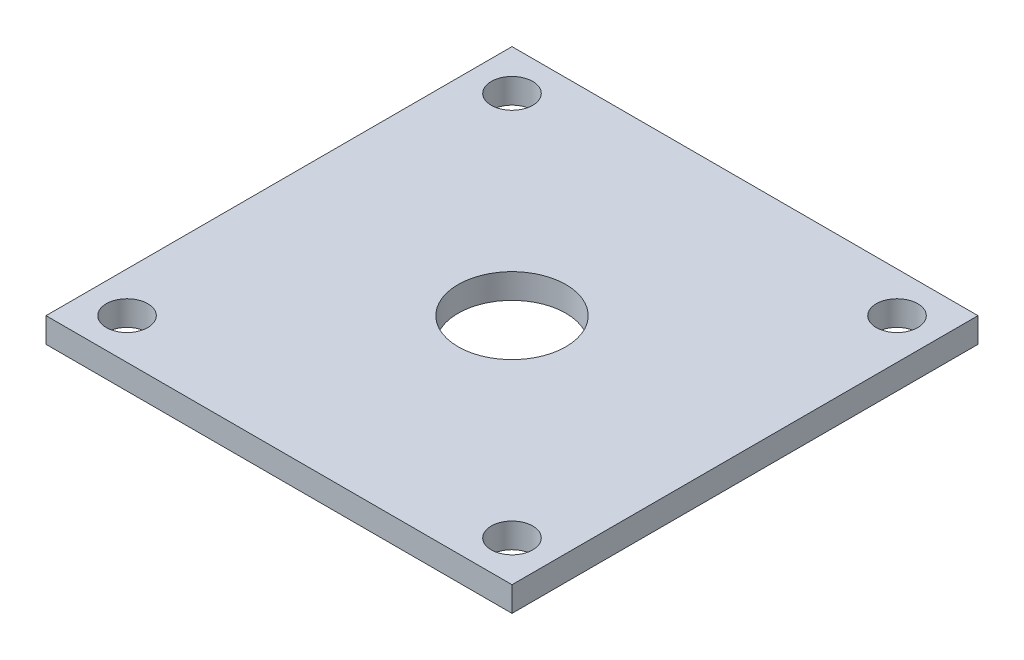
ISO-10303-21;
HEADER;
FILE_DESCRIPTION(('STEP AP214'),'2;1');
FILE_NAME('part.step','',(''),(''),'','','');
FILE_SCHEMA(('AUTOMOTIVE_DESIGN { 1 0 10303 214 1 1 1 1 }'));
ENDSEC;
DATA;
#1=APPLICATION_CONTEXT('core data for automotive mechanical design processes');
#2=APPLICATION_PROTOCOL_DEFINITION('international standard','automotive_design',2000,#1);
#3=PRODUCT_CONTEXT('',#1,'mechanical');
#4=PRODUCT('Part','Part','',(#3));
#5=PRODUCT_RELATED_PRODUCT_CATEGORY('part','',(#4));
#6=PRODUCT_DEFINITION_FORMATION('','',#4);
#7=PRODUCT_DEFINITION_CONTEXT('part definition',#1,'design');
#8=PRODUCT_DEFINITION('design','',#6,#7);
#9=PRODUCT_DEFINITION_SHAPE('','',#8);
#10=(LENGTH_UNIT() NAMED_UNIT(*) SI_UNIT(.MILLI.,.METRE.));
#11=(NAMED_UNIT(*) PLANE_ANGLE_UNIT() SI_UNIT($,.RADIAN.));
#12=(NAMED_UNIT(*) SI_UNIT($,.STERADIAN.) SOLID_ANGLE_UNIT());
#13=UNCERTAINTY_MEASURE_WITH_UNIT(LENGTH_MEASURE(1.E-05),#10,'distance_accuracy_value','');
#14=(GEOMETRIC_REPRESENTATION_CONTEXT(3) GLOBAL_UNCERTAINTY_ASSIGNED_CONTEXT((#13)) GLOBAL_UNIT_ASSIGNED_CONTEXT((#10,
#11,#12)) REPRESENTATION_CONTEXT('',''));
#15=CARTESIAN_POINT('',(0.,0.,0.));
#16=DIRECTION('',(0.,0.,1.));
#17=DIRECTION('',(1.,0.,0.));
#18=AXIS2_PLACEMENT_3D('',#15,#16,#17);
#19=CARTESIAN_POINT('',(35.687,88.9508,-35.687));
#20=DIRECTION('',(-1.,0.,0.));
#21=DIRECTION('',(0.,0.,1.));
#22=AXIS2_PLACEMENT_3D('',#19,#20,#21);
#23=PLANE('',#22);
#24=DIRECTION('',(0.,0.,1.));
#25=VECTOR('',#24,1.);
#26=CARTESIAN_POINT('',(35.687,85.1408,-35.687));
#27=LINE('',#26,#25);
#28=CARTESIAN_POINT('',(35.687,85.1408,-35.687));
#29=VERTEX_POINT('',#28);
#30=CARTESIAN_POINT('',(35.687,85.1408,35.687));
#31=VERTEX_POINT('',#30);
#32=EDGE_CURVE('E58',#29,#31,#27,.T.);
#33=ORIENTED_EDGE('',*,*,#32,.F.);
#34=DIRECTION('',(0.,-1.,0.));
#35=VECTOR('',#34,1.);
#36=CARTESIAN_POINT('',(35.687,88.9508,-35.687));
#37=LINE('',#36,#35);
#38=CARTESIAN_POINT('',(35.687,88.9508,-35.687));
#39=VERTEX_POINT('',#38);
#40=EDGE_CURVE('E12',#39,#29,#37,.T.);
#41=ORIENTED_EDGE('',*,*,#40,.F.);
#42=DIRECTION('',(0.,0.,-1.));
#43=VECTOR('',#42,1.);
#44=CARTESIAN_POINT('',(35.687,88.9508,-35.687));
#45=LINE('',#44,#43);
#46=CARTESIAN_POINT('',(35.687,88.9508,35.687));
#47=VERTEX_POINT('',#46);
#48=EDGE_CURVE('E121',#47,#39,#45,.T.);
#49=ORIENTED_EDGE('',*,*,#48,.F.);
#50=DIRECTION('',(0.,-1.,0.));
#51=VECTOR('',#50,1.);
#52=CARTESIAN_POINT('',(35.687,88.9508,35.687));
#53=LINE('',#52,#51);
#54=EDGE_CURVE('E108',#47,#31,#53,.T.);
#55=ORIENTED_EDGE('',*,*,#54,.T.);
#56=EDGE_LOOP('',(#33,#41,#49,#55));
#57=FACE_BOUND('',#56,.T.);
#58=ADVANCED_FACE('F42',(#57),#23,.F.);
#59=CARTESIAN_POINT('',(-35.687,88.9508,-35.687));
#60=DIRECTION('',(0.,0.,1.));
#61=DIRECTION('',(1.,0.,0.));
#62=AXIS2_PLACEMENT_3D('',#59,#60,#61);
#63=PLANE('',#62);
#64=DIRECTION('',(1.,0.,0.));
#65=VECTOR('',#64,1.);
#66=CARTESIAN_POINT('',(-35.687,85.1408,-35.687));
#67=LINE('',#66,#65);
#68=CARTESIAN_POINT('',(-35.687,85.1408,-35.687));
#69=VERTEX_POINT('',#68);
#70=EDGE_CURVE('E87',#69,#29,#67,.T.);
#71=ORIENTED_EDGE('',*,*,#70,.F.);
#72=DIRECTION('',(0.,-1.,0.));
#73=VECTOR('',#72,1.);
#74=CARTESIAN_POINT('',(-35.687,88.9508,-35.687));
#75=LINE('',#74,#73);
#76=CARTESIAN_POINT('',(-35.687,88.9508,-35.687));
#77=VERTEX_POINT('',#76);
#78=EDGE_CURVE('E51',#77,#69,#75,.T.);
#79=ORIENTED_EDGE('',*,*,#78,.F.);
#80=DIRECTION('',(-1.,0.,0.));
#81=VECTOR('',#80,1.);
#82=CARTESIAN_POINT('',(-35.687,88.9508,-35.687));
#83=LINE('',#82,#81);
#84=EDGE_CURVE('E118',#39,#77,#83,.T.);
#85=ORIENTED_EDGE('',*,*,#84,.F.);
#86=ORIENTED_EDGE('',*,*,#40,.T.);
#87=EDGE_LOOP('',(#71,#79,#85,#86));
#88=FACE_BOUND('',#87,.T.);
#89=ADVANCED_FACE('F97',(#88),#63,.F.);
#90=CARTESIAN_POINT('',(-35.687,88.9508,-35.687));
#91=DIRECTION('',(1.,0.,0.));
#92=DIRECTION('',(0.,0.,-1.));
#93=AXIS2_PLACEMENT_3D('',#90,#91,#92);
#94=PLANE('',#93);
#95=DIRECTION('',(0.,0.,1.));
#96=VECTOR('',#95,1.);
#97=CARTESIAN_POINT('',(-35.687,85.1408,-35.687));
#98=LINE('',#97,#96);
#99=CARTESIAN_POINT('',(-35.687,85.1408,35.687));
#100=VERTEX_POINT('',#99);
#101=EDGE_CURVE('E83',#69,#100,#98,.T.);
#102=ORIENTED_EDGE('',*,*,#101,.T.);
#103=DIRECTION('',(0.,-1.,0.));
#104=VECTOR('',#103,1.);
#105=CARTESIAN_POINT('',(-35.687,88.9508,35.687));
#106=LINE('',#105,#104);
#107=CARTESIAN_POINT('',(-35.687,88.9508,35.687));
#108=VERTEX_POINT('',#107);
#109=EDGE_CURVE('E105',#108,#100,#106,.T.);
#110=ORIENTED_EDGE('',*,*,#109,.F.);
#111=DIRECTION('',(0.,0.,1.));
#112=VECTOR('',#111,1.);
#113=CARTESIAN_POINT('',(-35.687,88.9508,-35.687));
#114=LINE('',#113,#112);
#115=EDGE_CURVE('E103',#77,#108,#114,.T.);
#116=ORIENTED_EDGE('',*,*,#115,.F.);
#117=ORIENTED_EDGE('',*,*,#78,.T.);
#118=EDGE_LOOP('',(#102,#110,#116,#117));
#119=FACE_BOUND('',#118,.T.);
#120=ADVANCED_FACE('F102',(#119),#94,.F.);
#121=CARTESIAN_POINT('',(-35.687,88.9508,35.687));
#122=DIRECTION('',(0.,0.,-1.));
#123=DIRECTION('',(-1.,0.,0.));
#124=AXIS2_PLACEMENT_3D('',#121,#122,#123);
#125=PLANE('',#124);
#126=DIRECTION('',(1.,0.,0.));
#127=VECTOR('',#126,1.);
#128=CARTESIAN_POINT('',(-35.687,85.1408,35.687));
#129=LINE('',#128,#127);
#130=EDGE_CURVE('E88',#100,#31,#129,.T.);
#131=ORIENTED_EDGE('',*,*,#130,.T.);
#132=ORIENTED_EDGE('',*,*,#54,.F.);
#133=DIRECTION('',(1.,0.,0.));
#134=VECTOR('',#133,1.);
#135=CARTESIAN_POINT('',(-35.687,88.9508,35.687));
#136=LINE('',#135,#134);
#137=EDGE_CURVE('E66',#108,#47,#136,.T.);
#138=ORIENTED_EDGE('',*,*,#137,.F.);
#139=ORIENTED_EDGE('',*,*,#109,.T.);
#140=EDGE_LOOP('',(#131,#132,#138,#139));
#141=FACE_BOUND('',#140,.T.);
#142=ADVANCED_FACE('F187',(#141),#125,.F.);
#143=CARTESIAN_POINT('',(0.,88.9528,0.));
#144=DIRECTION('',(0.,-1.,0.));
#145=DIRECTION('',(0.,0.,-1.));
#146=AXIS2_PLACEMENT_3D('',#143,#144,#145);
#147=CYLINDRICAL_SURFACE('',#146,8.255);
#148=CARTESIAN_POINT('',(0.,88.9508,0.));
#149=DIRECTION('',(0.,1.,0.));
#150=DIRECTION('',(0.,0.,1.));
#151=AXIS2_PLACEMENT_3D('',#148,#149,#150);
#152=CIRCLE('',#151,8.255);
#153=CARTESIAN_POINT('',(0.,88.9508,8.255));
#154=VERTEX_POINT('',#153);
#155=EDGE_CURVE('E124',#154,#154,#152,.F.);
#156=ORIENTED_EDGE('',*,*,#155,.F.);
#157=EDGE_LOOP('',(#156));
#158=FACE_BOUND('',#157,.T.);
#159=CARTESIAN_POINT('',(0.,85.1408,0.));
#160=DIRECTION('',(0.,-1.,0.));
#161=DIRECTION('',(0.,0.,-1.));
#162=AXIS2_PLACEMENT_3D('',#159,#160,#161);
#163=CIRCLE('',#162,8.255);
#164=CARTESIAN_POINT('',(0.,85.1408,-8.255));
#165=VERTEX_POINT('',#164);
#166=EDGE_CURVE('E45',#165,#165,#163,.F.);
#167=ORIENTED_EDGE('',*,*,#166,.F.);
#168=EDGE_LOOP('',(#167));
#169=FACE_BOUND('',#168,.T.);
#170=ADVANCED_FACE('F178',(#158,#169),#147,.F.);
#171=CARTESIAN_POINT('',(0.,88.9508,0.));
#172=DIRECTION('',(0.,1.,0.));
#173=DIRECTION('',(0.,0.,1.));
#174=AXIS2_PLACEMENT_3D('',#171,#172,#173);
#175=PLANE('',#174);
#176=CARTESIAN_POINT('',(29.4847950216924,88.9508,29.4847950216924));
#177=DIRECTION('',(0.,1.,0.));
#178=DIRECTION('',(0.,0.,1.));
#179=AXIS2_PLACEMENT_3D('',#176,#177,#178);
#180=CIRCLE('',#179,3.175);
#181=CARTESIAN_POINT('',(29.4847950216924,88.9508,32.6597950216924));
#182=VERTEX_POINT('',#181);
#183=EDGE_CURVE('E141',#182,#182,#180,.T.);
#184=ORIENTED_EDGE('',*,*,#183,.F.);
#185=EDGE_LOOP('',(#184));
#186=FACE_BOUND('',#185,.T.);
#187=CARTESIAN_POINT('',(-29.4825135870935,88.9508,-29.4825135870935));
#188=DIRECTION('',(0.,1.,0.));
#189=DIRECTION('',(0.,0.,1.));
#190=AXIS2_PLACEMENT_3D('',#187,#188,#189);
#191=CIRCLE('',#190,3.175);
#192=CARTESIAN_POINT('',(-29.4825135870935,88.9508,-26.3075135870935));
#193=VERTEX_POINT('',#192);
#194=EDGE_CURVE('E149',#193,#193,#191,.T.);
#195=ORIENTED_EDGE('',*,*,#194,.F.);
#196=EDGE_LOOP('',(#195));
#197=FACE_BOUND('',#196,.T.);
#198=CARTESIAN_POINT('',(29.4847950216924,88.9508,-29.4847950216924));
#199=DIRECTION('',(0.,1.,0.));
#200=DIRECTION('',(0.,0.,1.));
#201=AXIS2_PLACEMENT_3D('',#198,#199,#200);
#202=CIRCLE('',#201,3.175);
#203=CARTESIAN_POINT('',(29.4847950216924,88.9508,-26.3097950216924));
#204=VERTEX_POINT('',#203);
#205=EDGE_CURVE('E157',#204,#204,#202,.T.);
#206=ORIENTED_EDGE('',*,*,#205,.F.);
#207=EDGE_LOOP('',(#206));
#208=FACE_BOUND('',#207,.T.);
#209=CARTESIAN_POINT('',(-29.4812110895342,88.9508,29.4812110895342));
#210=DIRECTION('',(0.,1.,0.));
#211=DIRECTION('',(0.,0.,1.));
#212=AXIS2_PLACEMENT_3D('',#209,#210,#211);
#213=CIRCLE('',#212,3.175);
#214=CARTESIAN_POINT('',(-29.4812110895342,88.9508,32.6562110895342));
#215=VERTEX_POINT('',#214);
#216=EDGE_CURVE('E133',#215,#215,#213,.T.);
#217=ORIENTED_EDGE('',*,*,#216,.F.);
#218=EDGE_LOOP('',(#217));
#219=FACE_BOUND('',#218,.T.);
#220=ORIENTED_EDGE('',*,*,#155,.T.);
#221=EDGE_LOOP('',(#220));
#222=FACE_BOUND('',#221,.T.);
#223=ORIENTED_EDGE('',*,*,#48,.T.);
#224=ORIENTED_EDGE('',*,*,#84,.T.);
#225=ORIENTED_EDGE('',*,*,#115,.T.);
#226=ORIENTED_EDGE('',*,*,#137,.T.);
#227=EDGE_LOOP('',(#223,#224,#225,#226));
#228=FACE_BOUND('',#227,.T.);
#229=ADVANCED_FACE('F175',(#186,#197,#208,#219,#222,#228),#175,.T.);
#230=CARTESIAN_POINT('',(-35.687,85.1408,-35.687));
#231=DIRECTION('',(0.,-1.,0.));
#232=DIRECTION('',(0.,0.,-1.));
#233=AXIS2_PLACEMENT_3D('',#230,#231,#232);
#234=PLANE('',#233);
#235=CARTESIAN_POINT('',(29.4847950216924,85.1408,29.4847950216924));
#236=DIRECTION('',(0.,1.,0.));
#237=DIRECTION('',(0.,0.,1.));
#238=AXIS2_PLACEMENT_3D('',#235,#236,#237);
#239=CIRCLE('',#238,3.175);
#240=CARTESIAN_POINT('',(29.4847950216924,85.1408,32.6597950216924));
#241=VERTEX_POINT('',#240);
#242=EDGE_CURVE('E145',#241,#241,#239,.T.);
#243=ORIENTED_EDGE('',*,*,#242,.T.);
#244=EDGE_LOOP('',(#243));
#245=FACE_BOUND('',#244,.T.);
#246=CARTESIAN_POINT('',(-29.4825135870935,85.1408,-29.4825135870935));
#247=DIRECTION('',(0.,1.,0.));
#248=DIRECTION('',(0.,0.,1.));
#249=AXIS2_PLACEMENT_3D('',#246,#247,#248);
#250=CIRCLE('',#249,3.175);
#251=CARTESIAN_POINT('',(-29.4825135870935,85.1408,-26.3075135870935));
#252=VERTEX_POINT('',#251);
#253=EDGE_CURVE('E153',#252,#252,#250,.T.);
#254=ORIENTED_EDGE('',*,*,#253,.T.);
#255=EDGE_LOOP('',(#254));
#256=FACE_BOUND('',#255,.T.);
#257=CARTESIAN_POINT('',(29.4847950216924,85.1408,-29.4847950216924));
#258=DIRECTION('',(0.,1.,0.));
#259=DIRECTION('',(0.,0.,1.));
#260=AXIS2_PLACEMENT_3D('',#257,#258,#259);
#261=CIRCLE('',#260,3.175);
#262=CARTESIAN_POINT('',(29.4847950216924,85.1408,-26.3097950216924));
#263=VERTEX_POINT('',#262);
#264=EDGE_CURVE('E137',#263,#263,#261,.T.);
#265=ORIENTED_EDGE('',*,*,#264,.T.);
#266=EDGE_LOOP('',(#265));
#267=FACE_BOUND('',#266,.T.);
#268=CARTESIAN_POINT('',(-29.4812110895342,85.1408,29.4812110895342));
#269=DIRECTION('',(0.,1.,0.));
#270=DIRECTION('',(0.,0.,1.));
#271=AXIS2_PLACEMENT_3D('',#268,#269,#270);
#272=CIRCLE('',#271,3.175);
#273=CARTESIAN_POINT('',(-29.4812110895342,85.1408,32.6562110895342));
#274=VERTEX_POINT('',#273);
#275=EDGE_CURVE('E131',#274,#274,#272,.T.);
#276=ORIENTED_EDGE('',*,*,#275,.T.);
#277=EDGE_LOOP('',(#276));
#278=FACE_BOUND('',#277,.T.);
#279=ORIENTED_EDGE('',*,*,#130,.F.);
#280=ORIENTED_EDGE('',*,*,#101,.F.);
#281=ORIENTED_EDGE('',*,*,#70,.T.);
#282=ORIENTED_EDGE('',*,*,#32,.T.);
#283=EDGE_LOOP('',(#279,#280,#281,#282));
#284=FACE_BOUND('',#283,.T.);
#285=ORIENTED_EDGE('',*,*,#166,.T.);
#286=EDGE_LOOP('',(#285));
#287=FACE_BOUND('',#286,.T.);
#288=ADVANCED_FACE('F85',(#245,#256,#267,#278,#284,#287),#234,.T.);
#289=CARTESIAN_POINT('',(-29.4812110895342,85.1408,29.4812110895342));
#290=DIRECTION('',(0.,1.,0.));
#291=DIRECTION('',(0.,0.,1.));
#292=AXIS2_PLACEMENT_3D('',#289,#290,#291);
#293=CYLINDRICAL_SURFACE('',#292,3.175);
#294=ORIENTED_EDGE('',*,*,#275,.F.);
#295=EDGE_LOOP('',(#294));
#296=FACE_BOUND('',#295,.T.);
#297=ORIENTED_EDGE('',*,*,#216,.T.);
#298=EDGE_LOOP('',(#297));
#299=FACE_BOUND('',#298,.T.);
#300=ADVANCED_FACE('F171',(#296,#299),#293,.F.);
#301=CARTESIAN_POINT('',(29.4847950216924,85.1408,-29.4847950216924));
#302=DIRECTION('',(0.,1.,0.));
#303=DIRECTION('',(0.,0.,1.));
#304=AXIS2_PLACEMENT_3D('',#301,#302,#303);
#305=CYLINDRICAL_SURFACE('',#304,3.175);
#306=ORIENTED_EDGE('',*,*,#264,.F.);
#307=EDGE_LOOP('',(#306));
#308=FACE_BOUND('',#307,.T.);
#309=ORIENTED_EDGE('',*,*,#205,.T.);
#310=EDGE_LOOP('',(#309));
#311=FACE_BOUND('',#310,.T.);
#312=ADVANCED_FACE('F167',(#308,#311),#305,.F.);
#313=CARTESIAN_POINT('',(-29.4825135870935,85.1408,-29.4825135870935));
#314=DIRECTION('',(0.,1.,0.));
#315=DIRECTION('',(0.,0.,1.));
#316=AXIS2_PLACEMENT_3D('',#313,#314,#315);
#317=CYLINDRICAL_SURFACE('',#316,3.175);
#318=ORIENTED_EDGE('',*,*,#253,.F.);
#319=EDGE_LOOP('',(#318));
#320=FACE_BOUND('',#319,.T.);
#321=ORIENTED_EDGE('',*,*,#194,.T.);
#322=EDGE_LOOP('',(#321));
#323=FACE_BOUND('',#322,.T.);
#324=ADVANCED_FACE('F170',(#320,#323),#317,.F.);
#325=CARTESIAN_POINT('',(29.4847950216924,85.1408,29.4847950216924));
#326=DIRECTION('',(0.,1.,0.));
#327=DIRECTION('',(0.,0.,1.));
#328=AXIS2_PLACEMENT_3D('',#325,#326,#327);
#329=CYLINDRICAL_SURFACE('',#328,3.175);
#330=ORIENTED_EDGE('',*,*,#242,.F.);
#331=EDGE_LOOP('',(#330));
#332=FACE_BOUND('',#331,.T.);
#333=ORIENTED_EDGE('',*,*,#183,.T.);
#334=EDGE_LOOP('',(#333));
#335=FACE_BOUND('',#334,.T.);
#336=ADVANCED_FACE('F257',(#332,#335),#329,.F.);
#337=CLOSED_SHELL('',(#58,#89,#120,#142,#170,#229,#288,#300,#312,#324,#336));
#338=MANIFOLD_SOLID_BREP('B2',#337);
#339=ADVANCED_BREP_SHAPE_REPRESENTATION('',(#18,#338),#14);
#340=SHAPE_DEFINITION_REPRESENTATION(#9,#339);
ENDSEC;
END-ISO-10303-21;
